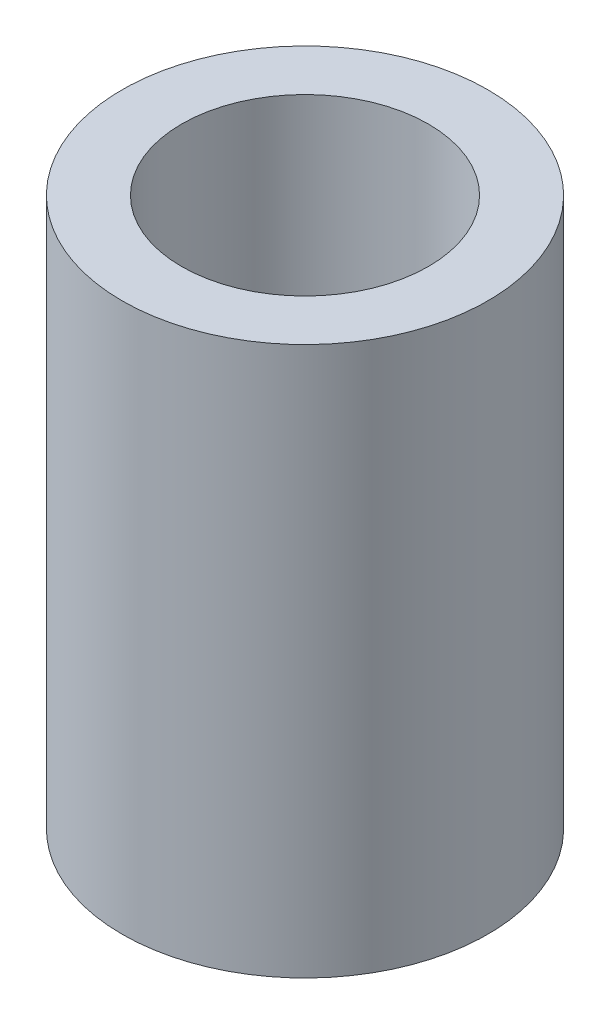
ISO-10303-21;
HEADER;
FILE_DESCRIPTION(('STEP AP214'),'2;1');
FILE_NAME('part.step','',(''),(''),'','','');
FILE_SCHEMA(('AUTOMOTIVE_DESIGN { 1 0 10303 214 1 1 1 1 }'));
ENDSEC;
DATA;
#1=APPLICATION_CONTEXT('core data for automotive mechanical design processes');
#2=APPLICATION_PROTOCOL_DEFINITION('international standard','automotive_design',2000,#1);
#3=PRODUCT_CONTEXT('',#1,'mechanical');
#4=PRODUCT('Part','Part','',(#3));
#5=PRODUCT_RELATED_PRODUCT_CATEGORY('part','',(#4));
#6=PRODUCT_DEFINITION_FORMATION('','',#4);
#7=PRODUCT_DEFINITION_CONTEXT('part definition',#1,'design');
#8=PRODUCT_DEFINITION('design','',#6,#7);
#9=PRODUCT_DEFINITION_SHAPE('','',#8);
#10=(LENGTH_UNIT() NAMED_UNIT(*) SI_UNIT(.MILLI.,.METRE.));
#11=(NAMED_UNIT(*) PLANE_ANGLE_UNIT() SI_UNIT($,.RADIAN.));
#12=(NAMED_UNIT(*) SI_UNIT($,.STERADIAN.) SOLID_ANGLE_UNIT());
#13=UNCERTAINTY_MEASURE_WITH_UNIT(LENGTH_MEASURE(1.E-05),#10,'distance_accuracy_value','');
#14=(GEOMETRIC_REPRESENTATION_CONTEXT(3) GLOBAL_UNCERTAINTY_ASSIGNED_CONTEXT((#13)) GLOBAL_UNIT_ASSIGNED_CONTEXT((#10,
#11,#12)) REPRESENTATION_CONTEXT('',''));
#15=CARTESIAN_POINT('',(0.,0.,0.));
#16=DIRECTION('',(0.,0.,1.));
#17=DIRECTION('',(1.,0.,0.));
#18=AXIS2_PLACEMENT_3D('',#15,#16,#17);
#19=CARTESIAN_POINT('',(0.,15.,0.));
#20=DIRECTION('',(0.,-1.,0.));
#21=DIRECTION('',(0.,0.,-1.));
#22=AXIS2_PLACEMENT_3D('',#19,#20,#21);
#23=CYLINDRICAL_SURFACE('',#22,5.);
#24=CARTESIAN_POINT('',(0.,15.,0.));
#25=DIRECTION('',(0.,1.,0.));
#26=DIRECTION('',(0.,0.,1.));
#27=AXIS2_PLACEMENT_3D('',#24,#25,#26);
#28=CIRCLE('',#27,5.);
#29=CARTESIAN_POINT('',(0.,15.,5.));
#30=VERTEX_POINT('',#29);
#31=EDGE_CURVE('E10',#30,#30,#28,.T.);
#32=ORIENTED_EDGE('',*,*,#31,.F.);
#33=EDGE_LOOP('',(#32));
#34=FACE_BOUND('',#33,.T.);
#35=CARTESIAN_POINT('',(0.,0.,0.));
#36=DIRECTION('',(0.,1.,0.));
#37=DIRECTION('',(0.,0.,1.));
#38=AXIS2_PLACEMENT_3D('',#35,#36,#37);
#39=CIRCLE('',#38,5.);
#40=CARTESIAN_POINT('',(0.,0.,5.));
#41=VERTEX_POINT('',#40);
#42=EDGE_CURVE('E34',#41,#41,#39,.T.);
#43=ORIENTED_EDGE('',*,*,#42,.T.);
#44=EDGE_LOOP('',(#43));
#45=FACE_BOUND('',#44,.T.);
#46=ADVANCED_FACE('F31',(#34,#45),#23,.T.);
#47=CARTESIAN_POINT('',(0.,15.,0.));
#48=DIRECTION('',(0.,1.,0.));
#49=DIRECTION('',(0.,0.,1.));
#50=AXIS2_PLACEMENT_3D('',#47,#48,#49);
#51=PLANE('',#50);
#52=CARTESIAN_POINT('',(0.,15.,0.));
#53=DIRECTION('',(0.,1.,0.));
#54=DIRECTION('',(0.,0.,1.));
#55=AXIS2_PLACEMENT_3D('',#52,#53,#54);
#56=CIRCLE('',#55,3.375);
#57=CARTESIAN_POINT('',(0.,15.,3.375));
#58=VERTEX_POINT('',#57);
#59=EDGE_CURVE('E41',#58,#58,#56,.T.);
#60=ORIENTED_EDGE('',*,*,#59,.F.);
#61=EDGE_LOOP('',(#60));
#62=FACE_BOUND('',#61,.T.);
#63=ORIENTED_EDGE('',*,*,#31,.T.);
#64=EDGE_LOOP('',(#63));
#65=FACE_BOUND('',#64,.T.);
#66=ADVANCED_FACE('F52',(#62,#65),#51,.T.);
#67=CARTESIAN_POINT('',(0.,0.,0.));
#68=DIRECTION('',(0.,1.,0.));
#69=DIRECTION('',(0.,0.,1.));
#70=AXIS2_PLACEMENT_3D('',#67,#68,#69);
#71=PLANE('',#70);
#72=CARTESIAN_POINT('',(0.,0.,0.));
#73=DIRECTION('',(0.,1.,0.));
#74=DIRECTION('',(0.,0.,1.));
#75=AXIS2_PLACEMENT_3D('',#72,#73,#74);
#76=CIRCLE('',#75,3.375);
#77=CARTESIAN_POINT('',(0.,0.,3.375));
#78=VERTEX_POINT('',#77);
#79=EDGE_CURVE('E43',#78,#78,#76,.T.);
#80=ORIENTED_EDGE('',*,*,#79,.T.);
#81=EDGE_LOOP('',(#80));
#82=FACE_BOUND('',#81,.T.);
#83=ORIENTED_EDGE('',*,*,#42,.F.);
#84=EDGE_LOOP('',(#83));
#85=FACE_BOUND('',#84,.T.);
#86=ADVANCED_FACE('F54',(#82,#85),#71,.F.);
#87=CARTESIAN_POINT('',(0.,15.,0.));
#88=DIRECTION('',(0.,-1.,0.));
#89=DIRECTION('',(0.,0.,-1.));
#90=AXIS2_PLACEMENT_3D('',#87,#88,#89);
#91=CYLINDRICAL_SURFACE('',#90,3.375);
#92=ORIENTED_EDGE('',*,*,#59,.T.);
#93=EDGE_LOOP('',(#92));
#94=FACE_BOUND('',#93,.T.);
#95=ORIENTED_EDGE('',*,*,#79,.F.);
#96=EDGE_LOOP('',(#95));
#97=FACE_BOUND('',#96,.T.);
#98=ADVANCED_FACE('F49',(#94,#97),#91,.F.);
#99=CLOSED_SHELL('',(#46,#66,#86,#98));
#100=MANIFOLD_SOLID_BREP('B2',#99);
#101=ADVANCED_BREP_SHAPE_REPRESENTATION('',(#18,#100),#14);
#102=SHAPE_DEFINITION_REPRESENTATION(#9,#101);
ENDSEC;
END-ISO-10303-21;
